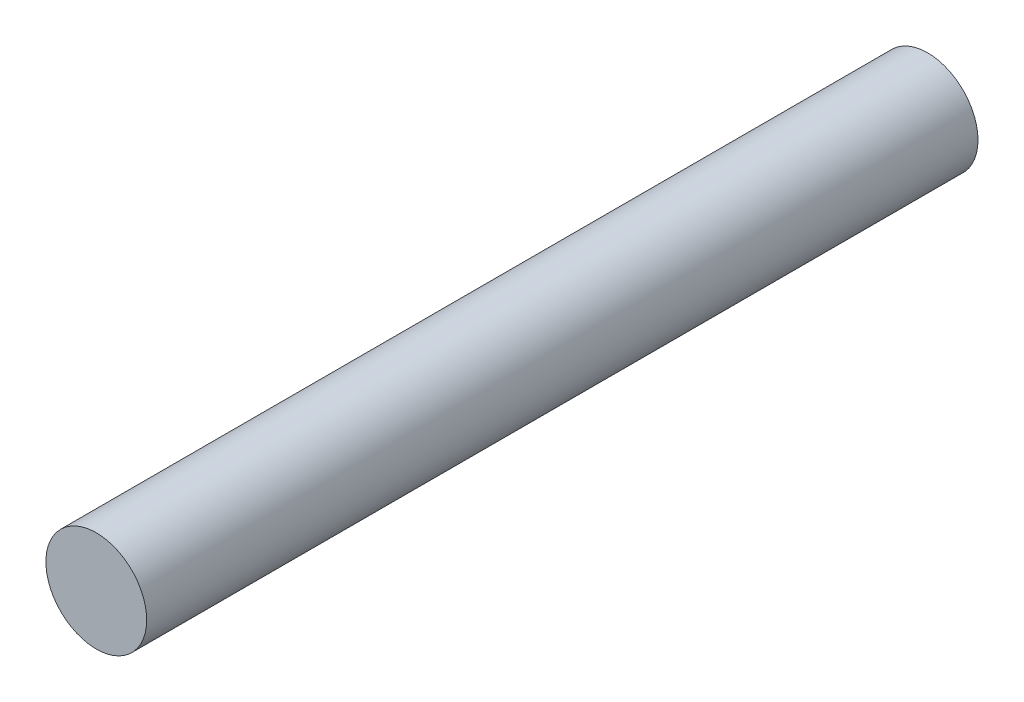
ISO-10303-21;
HEADER;
FILE_DESCRIPTION(('STEP AP214'),'2;1');
FILE_NAME('part.step','',(''),(''),'','','');
FILE_SCHEMA(('AUTOMOTIVE_DESIGN { 1 0 10303 214 1 1 1 1 }'));
ENDSEC;
DATA;
#1=APPLICATION_CONTEXT('core data for automotive mechanical design processes');
#2=APPLICATION_PROTOCOL_DEFINITION('international standard','automotive_design',2000,#1);
#3=PRODUCT_CONTEXT('',#1,'mechanical');
#4=PRODUCT('Part','Part','',(#3));
#5=PRODUCT_RELATED_PRODUCT_CATEGORY('part','',(#4));
#6=PRODUCT_DEFINITION_FORMATION('','',#4);
#7=PRODUCT_DEFINITION_CONTEXT('part definition',#1,'design');
#8=PRODUCT_DEFINITION('design','',#6,#7);
#9=PRODUCT_DEFINITION_SHAPE('','',#8);
#10=(LENGTH_UNIT() NAMED_UNIT(*) SI_UNIT(.MILLI.,.METRE.));
#11=(NAMED_UNIT(*) PLANE_ANGLE_UNIT() SI_UNIT($,.RADIAN.));
#12=(NAMED_UNIT(*) SI_UNIT($,.STERADIAN.) SOLID_ANGLE_UNIT());
#13=UNCERTAINTY_MEASURE_WITH_UNIT(LENGTH_MEASURE(1.E-05),#10,'distance_accuracy_value','');
#14=(GEOMETRIC_REPRESENTATION_CONTEXT(3) GLOBAL_UNCERTAINTY_ASSIGNED_CONTEXT((#13)) GLOBAL_UNIT_ASSIGNED_CONTEXT((#10,
#11,#12)) REPRESENTATION_CONTEXT('',''));
#15=CARTESIAN_POINT('',(0.,0.,0.));
#16=DIRECTION('',(0.,0.,1.));
#17=DIRECTION('',(1.,0.,0.));
#18=AXIS2_PLACEMENT_3D('',#15,#16,#17);
#19=CARTESIAN_POINT('',(0.,0.,66.));
#20=DIRECTION('',(0.,0.,-1.));
#21=DIRECTION('',(-1.,0.,0.));
#22=AXIS2_PLACEMENT_3D('',#19,#20,#21);
#23=CYLINDRICAL_SURFACE('',#22,4.);
#24=CARTESIAN_POINT('',(0.,0.,66.));
#25=DIRECTION('',(0.,0.,1.));
#26=DIRECTION('',(1.,0.,0.));
#27=AXIS2_PLACEMENT_3D('',#24,#25,#26);
#28=CIRCLE('',#27,4.);
#29=CARTESIAN_POINT('',(4.,0.,66.));
#30=VERTEX_POINT('',#29);
#31=EDGE_CURVE('E10',#30,#30,#28,.T.);
#32=ORIENTED_EDGE('',*,*,#31,.F.);
#33=EDGE_LOOP('',(#32));
#34=FACE_BOUND('',#33,.T.);
#35=CARTESIAN_POINT('',(0.,0.,0.));
#36=DIRECTION('',(0.,0.,1.));
#37=DIRECTION('',(1.,0.,0.));
#38=AXIS2_PLACEMENT_3D('',#35,#36,#37);
#39=CIRCLE('',#38,4.);
#40=CARTESIAN_POINT('',(4.,0.,0.));
#41=VERTEX_POINT('',#40);
#42=EDGE_CURVE('E34',#41,#41,#39,.T.);
#43=ORIENTED_EDGE('',*,*,#42,.T.);
#44=EDGE_LOOP('',(#43));
#45=FACE_BOUND('',#44,.T.);
#46=ADVANCED_FACE('F31',(#34,#45),#23,.T.);
#47=CARTESIAN_POINT('',(0.,0.,66.));
#48=DIRECTION('',(0.,0.,1.));
#49=DIRECTION('',(1.,0.,0.));
#50=AXIS2_PLACEMENT_3D('',#47,#48,#49);
#51=PLANE('',#50);
#52=ORIENTED_EDGE('',*,*,#31,.T.);
#53=EDGE_LOOP('',(#52));
#54=FACE_BOUND('',#53,.T.);
#55=ADVANCED_FACE('F46',(#54),#51,.T.);
#56=CARTESIAN_POINT('',(0.,0.,0.));
#57=DIRECTION('',(0.,0.,1.));
#58=DIRECTION('',(1.,0.,0.));
#59=AXIS2_PLACEMENT_3D('',#56,#57,#58);
#60=PLANE('',#59);
#61=ORIENTED_EDGE('',*,*,#42,.F.);
#62=EDGE_LOOP('',(#61));
#63=FACE_BOUND('',#62,.T.);
#64=ADVANCED_FACE('F44',(#63),#60,.F.);
#65=CLOSED_SHELL('',(#46,#55,#64));
#66=MANIFOLD_SOLID_BREP('B2',#65);
#67=ADVANCED_BREP_SHAPE_REPRESENTATION('',(#18,#66),#14);
#68=SHAPE_DEFINITION_REPRESENTATION(#9,#67);
ENDSEC;
END-ISO-10303-21;
